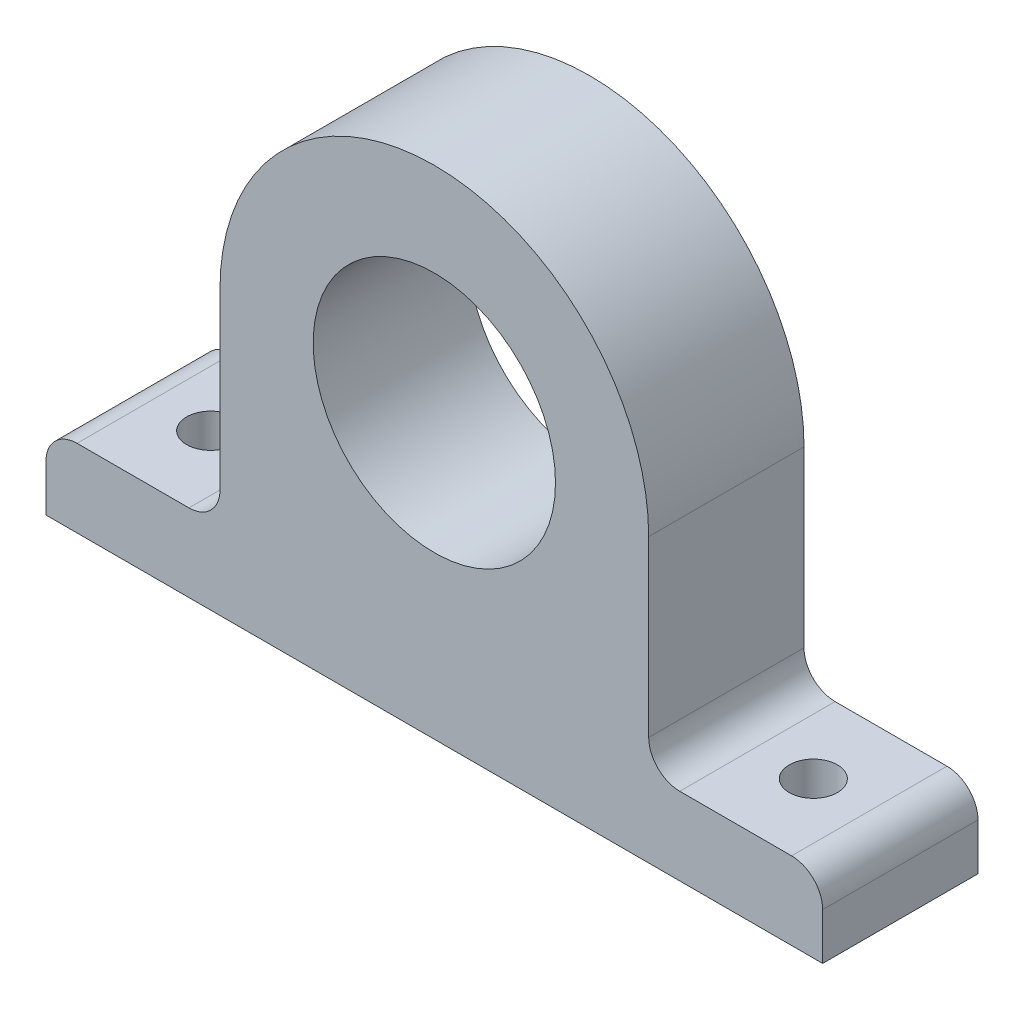
ISO-10303-21;
HEADER;
FILE_DESCRIPTION(('STEP AP214'),'2;1');
FILE_NAME('part.step','',(''),(''),'','','');
FILE_SCHEMA(('AUTOMOTIVE_DESIGN { 1 0 10303 214 1 1 1 1 }'));
ENDSEC;
DATA;
#1=APPLICATION_CONTEXT('core data for automotive mechanical design processes');
#2=APPLICATION_PROTOCOL_DEFINITION('international standard','automotive_design',2000,#1);
#3=PRODUCT_CONTEXT('',#1,'mechanical');
#4=PRODUCT('Part','Part','',(#3));
#5=PRODUCT_RELATED_PRODUCT_CATEGORY('part','',(#4));
#6=PRODUCT_DEFINITION_FORMATION('','',#4);
#7=PRODUCT_DEFINITION_CONTEXT('part definition',#1,'design');
#8=PRODUCT_DEFINITION('design','',#6,#7);
#9=PRODUCT_DEFINITION_SHAPE('','',#8);
#10=(LENGTH_UNIT() NAMED_UNIT(*) SI_UNIT(.MILLI.,.METRE.));
#11=(NAMED_UNIT(*) PLANE_ANGLE_UNIT() SI_UNIT($,.RADIAN.));
#12=(NAMED_UNIT(*) SI_UNIT($,.STERADIAN.) SOLID_ANGLE_UNIT());
#13=UNCERTAINTY_MEASURE_WITH_UNIT(LENGTH_MEASURE(1.E-05),#10,'distance_accuracy_value','');
#14=(GEOMETRIC_REPRESENTATION_CONTEXT(3) GLOBAL_UNCERTAINTY_ASSIGNED_CONTEXT((#13)) GLOBAL_UNIT_ASSIGNED_CONTEXT((#10,
#11,#12)) REPRESENTATION_CONTEXT('',''));
#15=CARTESIAN_POINT('',(0.,0.,0.));
#16=DIRECTION('',(0.,0.,1.));
#17=DIRECTION('',(1.,0.,0.));
#18=AXIS2_PLACEMENT_3D('',#15,#16,#17);
#19=CARTESIAN_POINT('',(-25.,0.,-10.));
#20=DIRECTION('',(-1.,0.,0.));
#21=DIRECTION('',(0.,0.,1.));
#22=AXIS2_PLACEMENT_3D('',#19,#20,#21);
#23=PLANE('',#22);
#24=DIRECTION('',(0.,-1.,0.));
#25=VECTOR('',#24,1.);
#26=CARTESIAN_POINT('',(-25.,0.,0.));
#27=LINE('',#26,#25);
#28=CARTESIAN_POINT('',(-25.,3.,0.));
#29=VERTEX_POINT('',#28);
#30=CARTESIAN_POINT('',(-25.,0.,0.));
#31=VERTEX_POINT('',#30);
#32=EDGE_CURVE('E166',#29,#31,#27,.T.);
#33=ORIENTED_EDGE('',*,*,#32,.F.);
#34=DIRECTION('',(0.,0.,1.));
#35=VECTOR('',#34,1.);
#36=CARTESIAN_POINT('',(-25.,3.,-10.));
#37=LINE('',#36,#35);
#38=CARTESIAN_POINT('',(-25.,3.,-10.));
#39=VERTEX_POINT('',#38);
#40=EDGE_CURVE('E131',#29,#39,#37,.F.);
#41=ORIENTED_EDGE('',*,*,#40,.T.);
#42=DIRECTION('',(0.,-1.,0.));
#43=VECTOR('',#42,1.);
#44=CARTESIAN_POINT('',(-25.,0.,-10.));
#45=LINE('',#44,#43);
#46=CARTESIAN_POINT('',(-25.,0.,-10.));
#47=VERTEX_POINT('',#46);
#48=EDGE_CURVE('E125',#39,#47,#45,.T.);
#49=ORIENTED_EDGE('',*,*,#48,.T.);
#50=DIRECTION('',(0.,0.,1.));
#51=VECTOR('',#50,1.);
#52=CARTESIAN_POINT('',(-25.,0.,-10.));
#53=LINE('',#52,#51);
#54=EDGE_CURVE('E128',#47,#31,#53,.T.);
#55=ORIENTED_EDGE('',*,*,#54,.T.);
#56=EDGE_LOOP('',(#33,#41,#49,#55));
#57=FACE_BOUND('',#56,.T.);
#58=ADVANCED_FACE('F35',(#57),#23,.T.);
#59=CARTESIAN_POINT('',(-25.,5.,-10.));
#60=DIRECTION('',(0.,1.,0.));
#61=DIRECTION('',(0.,0.,1.));
#62=AXIS2_PLACEMENT_3D('',#59,#60,#61);
#63=PLANE('',#62);
#64=CARTESIAN_POINT('',(-19.4,5.,-5.));
#65=DIRECTION('',(0.,1.,0.));
#66=DIRECTION('',(0.,0.,1.));
#67=AXIS2_PLACEMENT_3D('',#64,#65,#66);
#68=CIRCLE('',#67,1.55);
#69=CARTESIAN_POINT('',(-19.4,5.,-3.45));
#70=VERTEX_POINT('',#69);
#71=EDGE_CURVE('E315',#70,#70,#68,.T.);
#72=ORIENTED_EDGE('',*,*,#71,.F.);
#73=EDGE_LOOP('',(#72));
#74=FACE_BOUND('',#73,.T.);
#75=DIRECTION('',(-1.,0.,0.));
#76=VECTOR('',#75,1.);
#77=CARTESIAN_POINT('',(-25.,5.,-10.));
#78=LINE('',#77,#76);
#79=CARTESIAN_POINT('',(-15.8,5.,-10.));
#80=VERTEX_POINT('',#79);
#81=CARTESIAN_POINT('',(-23.,5.,-10.));
#82=VERTEX_POINT('',#81);
#83=EDGE_CURVE('E143',#80,#82,#78,.T.);
#84=ORIENTED_EDGE('',*,*,#83,.T.);
#85=DIRECTION('',(0.,0.,1.));
#86=VECTOR('',#85,1.);
#87=CARTESIAN_POINT('',(-23.,5.,-10.));
#88=LINE('',#87,#86);
#89=CARTESIAN_POINT('',(-23.,5.,0.));
#90=VERTEX_POINT('',#89);
#91=EDGE_CURVE('E210',#82,#90,#88,.T.);
#92=ORIENTED_EDGE('',*,*,#91,.T.);
#93=DIRECTION('',(-1.,0.,0.));
#94=VECTOR('',#93,1.);
#95=CARTESIAN_POINT('',(-25.,5.,0.));
#96=LINE('',#95,#94);
#97=CARTESIAN_POINT('',(-15.8,5.,0.));
#98=VERTEX_POINT('',#97);
#99=EDGE_CURVE('E135',#98,#90,#96,.T.);
#100=ORIENTED_EDGE('',*,*,#99,.F.);
#101=DIRECTION('',(0.,0.,1.));
#102=VECTOR('',#101,1.);
#103=CARTESIAN_POINT('',(-15.8,5.,-10.));
#104=LINE('',#103,#102);
#105=EDGE_CURVE('E208',#98,#80,#104,.F.);
#106=ORIENTED_EDGE('',*,*,#105,.T.);
#107=EDGE_LOOP('',(#84,#92,#100,#106));
#108=FACE_BOUND('',#107,.T.);
#109=ADVANCED_FACE('F229',(#74,#108),#63,.T.);
#110=CARTESIAN_POINT('',(-13.8,5.,-10.));
#111=DIRECTION('',(-1.,0.,0.));
#112=DIRECTION('',(0.,0.,1.));
#113=AXIS2_PLACEMENT_3D('',#110,#111,#112);
#114=PLANE('',#113);
#115=DIRECTION('',(0.,-1.,0.));
#116=VECTOR('',#115,1.);
#117=CARTESIAN_POINT('',(-13.8,5.,-10.));
#118=LINE('',#117,#116);
#119=CARTESIAN_POINT('',(-13.8,18.2,-10.));
#120=VERTEX_POINT('',#119);
#121=CARTESIAN_POINT('',(-13.8,7.,-10.));
#122=VERTEX_POINT('',#121);
#123=EDGE_CURVE('E162',#120,#122,#118,.T.);
#124=ORIENTED_EDGE('',*,*,#123,.T.);
#125=DIRECTION('',(0.,0.,1.));
#126=VECTOR('',#125,1.);
#127=CARTESIAN_POINT('',(-13.8,7.,0.));
#128=LINE('',#127,#126);
#129=CARTESIAN_POINT('',(-13.8,7.,0.));
#130=VERTEX_POINT('',#129);
#131=EDGE_CURVE('E215',#122,#130,#128,.T.);
#132=ORIENTED_EDGE('',*,*,#131,.T.);
#133=DIRECTION('',(0.,-1.,0.));
#134=VECTOR('',#133,1.);
#135=CARTESIAN_POINT('',(-13.8,5.,0.));
#136=LINE('',#135,#134);
#137=CARTESIAN_POINT('',(-13.8,18.2,0.));
#138=VERTEX_POINT('',#137);
#139=EDGE_CURVE('E181',#138,#130,#136,.T.);
#140=ORIENTED_EDGE('',*,*,#139,.F.);
#141=DIRECTION('',(0.,0.,1.));
#142=VECTOR('',#141,1.);
#143=CARTESIAN_POINT('',(-13.8,18.2,-10.));
#144=LINE('',#143,#142);
#145=EDGE_CURVE('E186',#120,#138,#144,.T.);
#146=ORIENTED_EDGE('',*,*,#145,.F.);
#147=EDGE_LOOP('',(#124,#132,#140,#146));
#148=FACE_BOUND('',#147,.T.);
#149=ADVANCED_FACE('F232',(#148),#114,.T.);
#150=CARTESIAN_POINT('',(0.,18.2,-10.));
#151=DIRECTION('',(0.,0.,1.));
#152=DIRECTION('',(1.,0.,0.));
#153=AXIS2_PLACEMENT_3D('',#150,#151,#152);
#154=CYLINDRICAL_SURFACE('',#153,13.8);
#155=CARTESIAN_POINT('',(0.,18.2,0.));
#156=DIRECTION('',(0.,0.,1.));
#157=DIRECTION('',(1.,0.,0.));
#158=AXIS2_PLACEMENT_3D('',#155,#156,#157);
#159=CIRCLE('',#158,13.8);
#160=CARTESIAN_POINT('',(13.8,18.2,0.));
#161=VERTEX_POINT('',#160);
#162=EDGE_CURVE('E178',#161,#138,#159,.T.);
#163=ORIENTED_EDGE('',*,*,#162,.F.);
#164=DIRECTION('',(0.,0.,1.));
#165=VECTOR('',#164,1.);
#166=CARTESIAN_POINT('',(13.8,18.2,-10.));
#167=LINE('',#166,#165);
#168=CARTESIAN_POINT('',(13.8,18.2,-10.));
#169=VERTEX_POINT('',#168);
#170=EDGE_CURVE('E189',#169,#161,#167,.T.);
#171=ORIENTED_EDGE('',*,*,#170,.F.);
#172=CARTESIAN_POINT('',(0.,18.2,-10.));
#173=DIRECTION('',(0.,0.,1.));
#174=DIRECTION('',(1.,0.,0.));
#175=AXIS2_PLACEMENT_3D('',#172,#173,#174);
#176=CIRCLE('',#175,13.8);
#177=EDGE_CURVE('E159',#169,#120,#176,.T.);
#178=ORIENTED_EDGE('',*,*,#177,.T.);
#179=ORIENTED_EDGE('',*,*,#145,.T.);
#180=EDGE_LOOP('',(#163,#171,#178,#179));
#181=FACE_BOUND('',#180,.T.);
#182=ADVANCED_FACE('F237',(#181),#154,.T.);
#183=CARTESIAN_POINT('',(13.8,5.,-10.));
#184=DIRECTION('',(1.,0.,0.));
#185=DIRECTION('',(0.,0.,-1.));
#186=AXIS2_PLACEMENT_3D('',#183,#184,#185);
#187=PLANE('',#186);
#188=DIRECTION('',(0.,1.,0.));
#189=VECTOR('',#188,1.);
#190=CARTESIAN_POINT('',(13.8,5.,0.));
#191=LINE('',#190,#189);
#192=CARTESIAN_POINT('',(13.8,7.,0.));
#193=VERTEX_POINT('',#192);
#194=EDGE_CURVE('E176',#193,#161,#191,.T.);
#195=ORIENTED_EDGE('',*,*,#194,.F.);
#196=DIRECTION('',(0.,0.,1.));
#197=VECTOR('',#196,1.);
#198=CARTESIAN_POINT('',(13.8,7.,-10.));
#199=LINE('',#198,#197);
#200=CARTESIAN_POINT('',(13.8,7.,-10.));
#201=VERTEX_POINT('',#200);
#202=EDGE_CURVE('E50',#193,#201,#199,.F.);
#203=ORIENTED_EDGE('',*,*,#202,.T.);
#204=DIRECTION('',(0.,1.,0.));
#205=VECTOR('',#204,1.);
#206=CARTESIAN_POINT('',(13.8,5.,-10.));
#207=LINE('',#206,#205);
#208=EDGE_CURVE('E157',#201,#169,#207,.T.);
#209=ORIENTED_EDGE('',*,*,#208,.T.);
#210=ORIENTED_EDGE('',*,*,#170,.T.);
#211=EDGE_LOOP('',(#195,#203,#209,#210));
#212=FACE_BOUND('',#211,.T.);
#213=ADVANCED_FACE('F238',(#212),#187,.T.);
#214=CARTESIAN_POINT('',(25.,5.,-10.));
#215=DIRECTION('',(0.,1.,0.));
#216=DIRECTION('',(0.,0.,1.));
#217=AXIS2_PLACEMENT_3D('',#214,#215,#216);
#218=PLANE('',#217);
#219=CARTESIAN_POINT('',(19.4,5.,-5.));
#220=DIRECTION('',(0.,-1.,0.));
#221=DIRECTION('',(0.,0.,1.));
#222=AXIS2_PLACEMENT_3D('',#219,#220,#221);
#223=CIRCLE('',#222,1.55);
#224=CARTESIAN_POINT('',(19.4,5.,-3.45));
#225=VERTEX_POINT('',#224);
#226=EDGE_CURVE('E310',#225,#225,#223,.T.);
#227=ORIENTED_EDGE('',*,*,#226,.T.);
#228=EDGE_LOOP('',(#227));
#229=FACE_BOUND('',#228,.T.);
#230=DIRECTION('',(-1.,0.,0.));
#231=VECTOR('',#230,1.);
#232=CARTESIAN_POINT('',(25.,5.,0.));
#233=LINE('',#232,#231);
#234=CARTESIAN_POINT('',(23.,5.,0.));
#235=VERTEX_POINT('',#234);
#236=CARTESIAN_POINT('',(15.8,5.,0.));
#237=VERTEX_POINT('',#236);
#238=EDGE_CURVE('E173',#235,#237,#233,.T.);
#239=ORIENTED_EDGE('',*,*,#238,.F.);
#240=DIRECTION('',(0.,0.,1.));
#241=VECTOR('',#240,1.);
#242=CARTESIAN_POINT('',(23.,5.,-10.));
#243=LINE('',#242,#241);
#244=CARTESIAN_POINT('',(23.,5.,-10.));
#245=VERTEX_POINT('',#244);
#246=EDGE_CURVE('E202',#235,#245,#243,.F.);
#247=ORIENTED_EDGE('',*,*,#246,.T.);
#248=DIRECTION('',(-1.,0.,0.));
#249=VECTOR('',#248,1.);
#250=CARTESIAN_POINT('',(25.,5.,-10.));
#251=LINE('',#250,#249);
#252=CARTESIAN_POINT('',(15.8,5.,-10.));
#253=VERTEX_POINT('',#252);
#254=EDGE_CURVE('E151',#245,#253,#251,.T.);
#255=ORIENTED_EDGE('',*,*,#254,.T.);
#256=DIRECTION('',(0.,0.,1.));
#257=VECTOR('',#256,1.);
#258=CARTESIAN_POINT('',(15.8,5.,0.));
#259=LINE('',#258,#257);
#260=EDGE_CURVE('E199',#253,#237,#259,.T.);
#261=ORIENTED_EDGE('',*,*,#260,.T.);
#262=EDGE_LOOP('',(#239,#247,#255,#261));
#263=FACE_BOUND('',#262,.T.);
#264=ADVANCED_FACE('F245',(#229,#263),#218,.T.);
#265=CARTESIAN_POINT('',(25.,0.,-10.));
#266=DIRECTION('',(1.,0.,0.));
#267=DIRECTION('',(0.,0.,-1.));
#268=AXIS2_PLACEMENT_3D('',#265,#266,#267);
#269=PLANE('',#268);
#270=DIRECTION('',(0.,1.,0.));
#271=VECTOR('',#270,1.);
#272=CARTESIAN_POINT('',(25.,0.,-10.));
#273=LINE('',#272,#271);
#274=CARTESIAN_POINT('',(25.,0.,-10.));
#275=VERTEX_POINT('',#274);
#276=CARTESIAN_POINT('',(25.,3.,-10.));
#277=VERTEX_POINT('',#276);
#278=EDGE_CURVE('E149',#275,#277,#273,.T.);
#279=ORIENTED_EDGE('',*,*,#278,.T.);
#280=DIRECTION('',(0.,0.,1.));
#281=VECTOR('',#280,1.);
#282=CARTESIAN_POINT('',(25.,3.,-10.));
#283=LINE('',#282,#281);
#284=CARTESIAN_POINT('',(25.,3.,0.));
#285=VERTEX_POINT('',#284);
#286=EDGE_CURVE('E188',#277,#285,#283,.T.);
#287=ORIENTED_EDGE('',*,*,#286,.T.);
#288=DIRECTION('',(0.,1.,0.));
#289=VECTOR('',#288,1.);
#290=CARTESIAN_POINT('',(25.,0.,0.));
#291=LINE('',#290,#289);
#292=CARTESIAN_POINT('',(25.,0.,0.));
#293=VERTEX_POINT('',#292);
#294=EDGE_CURVE('E170',#293,#285,#291,.T.);
#295=ORIENTED_EDGE('',*,*,#294,.F.);
#296=DIRECTION('',(0.,0.,1.));
#297=VECTOR('',#296,1.);
#298=CARTESIAN_POINT('',(25.,0.,-10.));
#299=LINE('',#298,#297);
#300=EDGE_CURVE('E142',#275,#293,#299,.T.);
#301=ORIENTED_EDGE('',*,*,#300,.F.);
#302=EDGE_LOOP('',(#279,#287,#295,#301));
#303=FACE_BOUND('',#302,.T.);
#304=ADVANCED_FACE('F253',(#303),#269,.T.);
#305=CARTESIAN_POINT('',(-25.,0.,-10.));
#306=DIRECTION('',(0.,-1.,0.));
#307=DIRECTION('',(0.,0.,-1.));
#308=AXIS2_PLACEMENT_3D('',#305,#306,#307);
#309=PLANE('',#308);
#310=CARTESIAN_POINT('',(19.4,0.,-5.));
#311=DIRECTION('',(0.,-1.,0.));
#312=DIRECTION('',(0.,0.,-1.));
#313=AXIS2_PLACEMENT_3D('',#310,#311,#312);
#314=CIRCLE('',#313,1.55);
#315=CARTESIAN_POINT('',(19.4,0.,-6.55));
#316=VERTEX_POINT('',#315);
#317=EDGE_CURVE('E307',#316,#316,#314,.T.);
#318=ORIENTED_EDGE('',*,*,#317,.F.);
#319=EDGE_LOOP('',(#318));
#320=FACE_BOUND('',#319,.T.);
#321=CARTESIAN_POINT('',(-19.4,0.,-5.));
#322=DIRECTION('',(0.,-1.,0.));
#323=DIRECTION('',(0.,0.,-1.));
#324=AXIS2_PLACEMENT_3D('',#321,#322,#323);
#325=CIRCLE('',#324,1.55);
#326=CARTESIAN_POINT('',(-19.4,0.,-6.55));
#327=VERTEX_POINT('',#326);
#328=EDGE_CURVE('E312',#327,#327,#325,.F.);
#329=ORIENTED_EDGE('',*,*,#328,.T.);
#330=EDGE_LOOP('',(#329));
#331=FACE_BOUND('',#330,.T.);
#332=DIRECTION('',(1.,0.,0.));
#333=VECTOR('',#332,1.);
#334=CARTESIAN_POINT('',(-25.,0.,0.));
#335=LINE('',#334,#333);
#336=EDGE_CURVE('E141',#31,#293,#335,.T.);
#337=ORIENTED_EDGE('',*,*,#336,.F.);
#338=ORIENTED_EDGE('',*,*,#54,.F.);
#339=DIRECTION('',(1.,0.,0.));
#340=VECTOR('',#339,1.);
#341=CARTESIAN_POINT('',(-25.,0.,-10.));
#342=LINE('',#341,#340);
#343=EDGE_CURVE('E134',#47,#275,#342,.T.);
#344=ORIENTED_EDGE('',*,*,#343,.T.);
#345=ORIENTED_EDGE('',*,*,#300,.T.);
#346=EDGE_LOOP('',(#337,#338,#344,#345));
#347=FACE_BOUND('',#346,.T.);
#348=ADVANCED_FACE('F139',(#320,#331,#347),#309,.T.);
#349=CARTESIAN_POINT('',(0.,18.2,-10.));
#350=DIRECTION('',(0.,0.,1.));
#351=DIRECTION('',(1.,0.,0.));
#352=AXIS2_PLACEMENT_3D('',#349,#350,#351);
#353=PLANE('',#352);
#354=CARTESIAN_POINT('',(0.,18.2,-10.));
#355=DIRECTION('',(0.,0.,1.));
#356=DIRECTION('',(1.,0.,0.));
#357=AXIS2_PLACEMENT_3D('',#354,#355,#356);
#358=CIRCLE('',#357,7.8);
#359=CARTESIAN_POINT('',(7.8,18.2,-10.));
#360=VERTEX_POINT('',#359);
#361=EDGE_CURVE('E168',#360,#360,#358,.T.);
#362=ORIENTED_EDGE('',*,*,#361,.T.);
#363=EDGE_LOOP('',(#362));
#364=FACE_BOUND('',#363,.T.);
#365=ORIENTED_EDGE('',*,*,#254,.F.);
#366=CARTESIAN_POINT('',(23.,3.,-10.));
#367=DIRECTION('',(0.,0.,1.));
#368=DIRECTION('',(1.,0.,0.));
#369=AXIS2_PLACEMENT_3D('',#366,#367,#368);
#370=CIRCLE('',#369,2.);
#371=EDGE_CURVE('E206',#245,#277,#370,.F.);
#372=ORIENTED_EDGE('',*,*,#371,.T.);
#373=ORIENTED_EDGE('',*,*,#278,.F.);
#374=ORIENTED_EDGE('',*,*,#343,.F.);
#375=ORIENTED_EDGE('',*,*,#48,.F.);
#376=CARTESIAN_POINT('',(-23.,3.,-10.));
#377=DIRECTION('',(0.,0.,1.));
#378=DIRECTION('',(1.,0.,0.));
#379=AXIS2_PLACEMENT_3D('',#376,#377,#378);
#380=CIRCLE('',#379,2.);
#381=EDGE_CURVE('E204',#39,#82,#380,.F.);
#382=ORIENTED_EDGE('',*,*,#381,.T.);
#383=ORIENTED_EDGE('',*,*,#83,.F.);
#384=CARTESIAN_POINT('',(-15.8,7.,-10.));
#385=DIRECTION('',(0.,0.,1.));
#386=DIRECTION('',(1.,0.,0.));
#387=AXIS2_PLACEMENT_3D('',#384,#385,#386);
#388=CIRCLE('',#387,2.);
#389=EDGE_CURVE('E11',#80,#122,#388,.T.);
#390=ORIENTED_EDGE('',*,*,#389,.T.);
#391=ORIENTED_EDGE('',*,*,#123,.F.);
#392=ORIENTED_EDGE('',*,*,#177,.F.);
#393=ORIENTED_EDGE('',*,*,#208,.F.);
#394=CARTESIAN_POINT('',(15.8,7.,-10.));
#395=DIRECTION('',(0.,0.,1.));
#396=DIRECTION('',(1.,0.,0.));
#397=AXIS2_PLACEMENT_3D('',#394,#395,#396);
#398=CIRCLE('',#397,2.);
#399=EDGE_CURVE('E220',#201,#253,#398,.T.);
#400=ORIENTED_EDGE('',*,*,#399,.T.);
#401=EDGE_LOOP('',(#365,#372,#373,#374,#375,#382,#383,#390,#391,#392,#393,#400));
#402=FACE_BOUND('',#401,.T.);
#403=ADVANCED_FACE('F147',(#364,#402),#353,.F.);
#404=CARTESIAN_POINT('',(0.,18.2,0.));
#405=DIRECTION('',(0.,0.,1.));
#406=DIRECTION('',(1.,0.,0.));
#407=AXIS2_PLACEMENT_3D('',#404,#405,#406);
#408=PLANE('',#407);
#409=CARTESIAN_POINT('',(0.,18.2,0.));
#410=DIRECTION('',(0.,0.,1.));
#411=DIRECTION('',(1.,0.,0.));
#412=AXIS2_PLACEMENT_3D('',#409,#410,#411);
#413=CIRCLE('',#412,7.8);
#414=CARTESIAN_POINT('',(7.8,18.2,0.));
#415=VERTEX_POINT('',#414);
#416=EDGE_CURVE('E318',#415,#415,#413,.T.);
#417=ORIENTED_EDGE('',*,*,#416,.F.);
#418=EDGE_LOOP('',(#417));
#419=FACE_BOUND('',#418,.T.);
#420=ORIENTED_EDGE('',*,*,#294,.T.);
#421=CARTESIAN_POINT('',(23.,3.,0.));
#422=DIRECTION('',(0.,0.,1.));
#423=DIRECTION('',(1.,0.,0.));
#424=AXIS2_PLACEMENT_3D('',#421,#422,#423);
#425=CIRCLE('',#424,2.);
#426=EDGE_CURVE('E197',#285,#235,#425,.T.);
#427=ORIENTED_EDGE('',*,*,#426,.T.);
#428=ORIENTED_EDGE('',*,*,#238,.T.);
#429=CARTESIAN_POINT('',(15.8,7.,0.));
#430=DIRECTION('',(0.,0.,1.));
#431=DIRECTION('',(1.,0.,0.));
#432=AXIS2_PLACEMENT_3D('',#429,#430,#431);
#433=CIRCLE('',#432,2.);
#434=EDGE_CURVE('E218',#237,#193,#433,.F.);
#435=ORIENTED_EDGE('',*,*,#434,.T.);
#436=ORIENTED_EDGE('',*,*,#194,.T.);
#437=ORIENTED_EDGE('',*,*,#162,.T.);
#438=ORIENTED_EDGE('',*,*,#139,.T.);
#439=CARTESIAN_POINT('',(-15.8,7.,0.));
#440=DIRECTION('',(0.,0.,1.));
#441=DIRECTION('',(1.,0.,0.));
#442=AXIS2_PLACEMENT_3D('',#439,#440,#441);
#443=CIRCLE('',#442,2.);
#444=EDGE_CURVE('E43',#130,#98,#443,.F.);
#445=ORIENTED_EDGE('',*,*,#444,.T.);
#446=ORIENTED_EDGE('',*,*,#99,.T.);
#447=CARTESIAN_POINT('',(-23.,3.,0.));
#448=DIRECTION('',(0.,0.,1.));
#449=DIRECTION('',(1.,0.,0.));
#450=AXIS2_PLACEMENT_3D('',#447,#448,#449);
#451=CIRCLE('',#450,2.);
#452=EDGE_CURVE('E195',#90,#29,#451,.T.);
#453=ORIENTED_EDGE('',*,*,#452,.T.);
#454=ORIENTED_EDGE('',*,*,#32,.T.);
#455=ORIENTED_EDGE('',*,*,#336,.T.);
#456=EDGE_LOOP('',(#420,#427,#428,#435,#436,#437,#438,#445,#446,#453,#454,#455));
#457=FACE_BOUND('',#456,.T.);
#458=ADVANCED_FACE('F223',(#419,#457),#408,.T.);
#459=CARTESIAN_POINT('',(0.,18.2,-10.));
#460=DIRECTION('',(0.,0.,1.));
#461=DIRECTION('',(1.,0.,0.));
#462=AXIS2_PLACEMENT_3D('',#459,#460,#461);
#463=CYLINDRICAL_SURFACE('',#462,7.8);
#464=ORIENTED_EDGE('',*,*,#361,.F.);
#465=EDGE_LOOP('',(#464));
#466=FACE_BOUND('',#465,.T.);
#467=ORIENTED_EDGE('',*,*,#416,.T.);
#468=EDGE_LOOP('',(#467));
#469=FACE_BOUND('',#468,.T.);
#470=ADVANCED_FACE('F288',(#466,#469),#463,.F.);
#471=CARTESIAN_POINT('',(-19.4,-0.00100000000000013,-5.));
#472=DIRECTION('',(0.,1.,0.));
#473=DIRECTION('',(0.,0.,1.));
#474=AXIS2_PLACEMENT_3D('',#471,#472,#473);
#475=CYLINDRICAL_SURFACE('',#474,1.55);
#476=ORIENTED_EDGE('',*,*,#328,.F.);
#477=EDGE_LOOP('',(#476));
#478=FACE_BOUND('',#477,.T.);
#479=ORIENTED_EDGE('',*,*,#71,.T.);
#480=EDGE_LOOP('',(#479));
#481=FACE_BOUND('',#480,.T.);
#482=ADVANCED_FACE('F295',(#478,#481),#475,.F.);
#483=CARTESIAN_POINT('',(19.4,-0.00100000000000013,-5.));
#484=DIRECTION('',(0.,1.,0.));
#485=DIRECTION('',(0.,0.,1.));
#486=AXIS2_PLACEMENT_3D('',#483,#484,#485);
#487=CYLINDRICAL_SURFACE('',#486,1.55);
#488=ORIENTED_EDGE('',*,*,#317,.T.);
#489=EDGE_LOOP('',(#488));
#490=FACE_BOUND('',#489,.T.);
#491=ORIENTED_EDGE('',*,*,#226,.F.);
#492=EDGE_LOOP('',(#491));
#493=FACE_BOUND('',#492,.T.);
#494=ADVANCED_FACE('F262',(#490,#493),#487,.F.);
#495=CARTESIAN_POINT('',(23.,3.,-10.));
#496=DIRECTION('',(0.,0.,1.));
#497=DIRECTION('',(1.,0.,0.));
#498=AXIS2_PLACEMENT_3D('',#495,#496,#497);
#499=CYLINDRICAL_SURFACE('',#498,2.);
#500=ORIENTED_EDGE('',*,*,#371,.F.);
#501=ORIENTED_EDGE('',*,*,#246,.F.);
#502=ORIENTED_EDGE('',*,*,#426,.F.);
#503=ORIENTED_EDGE('',*,*,#286,.F.);
#504=EDGE_LOOP('',(#500,#501,#502,#503));
#505=FACE_BOUND('',#504,.T.);
#506=ADVANCED_FACE('F251',(#505),#499,.T.);
#507=CARTESIAN_POINT('',(-23.,3.,-10.));
#508=DIRECTION('',(0.,0.,1.));
#509=DIRECTION('',(1.,0.,0.));
#510=AXIS2_PLACEMENT_3D('',#507,#508,#509);
#511=CYLINDRICAL_SURFACE('',#510,2.);
#512=ORIENTED_EDGE('',*,*,#381,.F.);
#513=ORIENTED_EDGE('',*,*,#40,.F.);
#514=ORIENTED_EDGE('',*,*,#452,.F.);
#515=ORIENTED_EDGE('',*,*,#91,.F.);
#516=EDGE_LOOP('',(#512,#513,#514,#515));
#517=FACE_BOUND('',#516,.T.);
#518=ADVANCED_FACE('F255',(#517),#511,.T.);
#519=CARTESIAN_POINT('',(15.8,7.,-10.));
#520=DIRECTION('',(0.,0.,-1.));
#521=DIRECTION('',(-1.,0.,0.));
#522=AXIS2_PLACEMENT_3D('',#519,#520,#521);
#523=CYLINDRICAL_SURFACE('',#522,2.);
#524=ORIENTED_EDGE('',*,*,#399,.F.);
#525=ORIENTED_EDGE('',*,*,#202,.F.);
#526=ORIENTED_EDGE('',*,*,#434,.F.);
#527=ORIENTED_EDGE('',*,*,#260,.F.);
#528=EDGE_LOOP('',(#524,#525,#526,#527));
#529=FACE_BOUND('',#528,.T.);
#530=ADVANCED_FACE('F242',(#529),#523,.F.);
#531=CARTESIAN_POINT('',(-15.8,7.,-10.));
#532=DIRECTION('',(0.,0.,-1.));
#533=DIRECTION('',(-1.,0.,0.));
#534=AXIS2_PLACEMENT_3D('',#531,#532,#533);
#535=CYLINDRICAL_SURFACE('',#534,2.);
#536=ORIENTED_EDGE('',*,*,#389,.F.);
#537=ORIENTED_EDGE('',*,*,#105,.F.);
#538=ORIENTED_EDGE('',*,*,#444,.F.);
#539=ORIENTED_EDGE('',*,*,#131,.F.);
#540=EDGE_LOOP('',(#536,#537,#538,#539));
#541=FACE_BOUND('',#540,.T.);
#542=ADVANCED_FACE('F37',(#541),#535,.F.);
#543=CLOSED_SHELL('',(#58,#109,#149,#182,#213,#264,#304,#348,#403,#458,#470,#482,#494,#506,#518,
#530,#542));
#544=MANIFOLD_SOLID_BREP('B2',#543);
#545=ADVANCED_BREP_SHAPE_REPRESENTATION('',(#18,#544),#14);
#546=SHAPE_DEFINITION_REPRESENTATION(#9,#545);
ENDSEC;
END-ISO-10303-21;
